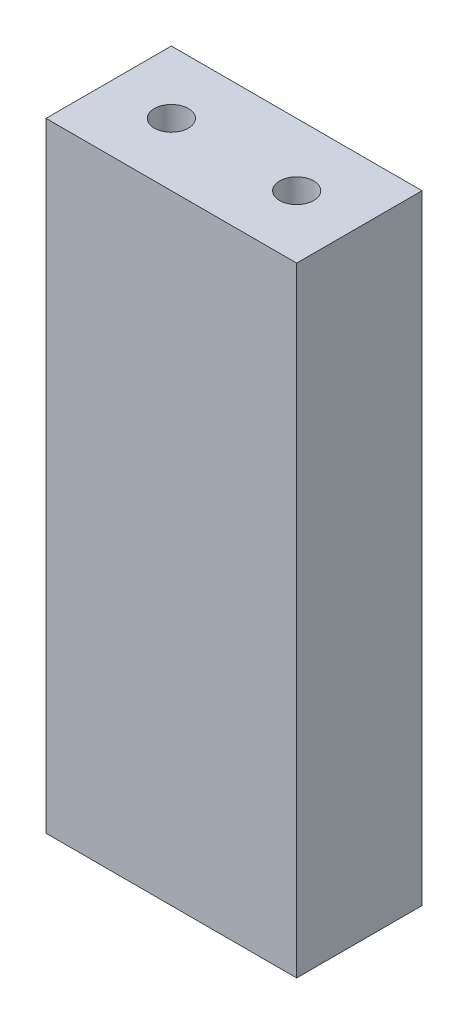
ISO-10303-21;
HEADER;
FILE_DESCRIPTION(('STEP AP214'),'2;1');
FILE_NAME('part.step','',(''),(''),'','','');
FILE_SCHEMA(('AUTOMOTIVE_DESIGN { 1 0 10303 214 1 1 1 1 }'));
ENDSEC;
DATA;
#1=APPLICATION_CONTEXT('core data for automotive mechanical design processes');
#2=APPLICATION_PROTOCOL_DEFINITION('international standard','automotive_design',2000,#1);
#3=PRODUCT_CONTEXT('',#1,'mechanical');
#4=PRODUCT('Part','Part','',(#3));
#5=PRODUCT_RELATED_PRODUCT_CATEGORY('part','',(#4));
#6=PRODUCT_DEFINITION_FORMATION('','',#4);
#7=PRODUCT_DEFINITION_CONTEXT('part definition',#1,'design');
#8=PRODUCT_DEFINITION('design','',#6,#7);
#9=PRODUCT_DEFINITION_SHAPE('','',#8);
#10=(LENGTH_UNIT() NAMED_UNIT(*) SI_UNIT(.MILLI.,.METRE.));
#11=(NAMED_UNIT(*) PLANE_ANGLE_UNIT() SI_UNIT($,.RADIAN.));
#12=(NAMED_UNIT(*) SI_UNIT($,.STERADIAN.) SOLID_ANGLE_UNIT());
#13=UNCERTAINTY_MEASURE_WITH_UNIT(LENGTH_MEASURE(1.E-05),#10,'distance_accuracy_value','');
#14=(GEOMETRIC_REPRESENTATION_CONTEXT(3) GLOBAL_UNCERTAINTY_ASSIGNED_CONTEXT((#13)) GLOBAL_UNIT_ASSIGNED_CONTEXT((#10,
#11,#12)) REPRESENTATION_CONTEXT('',''));
#15=CARTESIAN_POINT('',(0.,0.,0.));
#16=DIRECTION('',(0.,0.,1.));
#17=DIRECTION('',(1.,0.,0.));
#18=AXIS2_PLACEMENT_3D('',#15,#16,#17);
#19=CARTESIAN_POINT('',(0.,62.738,0.));
#20=DIRECTION('',(1.,0.,0.));
#21=DIRECTION('',(0.,0.,-1.));
#22=AXIS2_PLACEMENT_3D('',#19,#20,#21);
#23=PLANE('',#22);
#24=DIRECTION('',(0.,0.,1.));
#25=VECTOR('',#24,1.);
#26=CARTESIAN_POINT('',(0.,0.,0.));
#27=LINE('',#26,#25);
#28=CARTESIAN_POINT('',(0.,0.,0.));
#29=VERTEX_POINT('',#28);
#30=CARTESIAN_POINT('',(0.,0.,12.7));
#31=VERTEX_POINT('',#30);
#32=EDGE_CURVE('E131',#29,#31,#27,.T.);
#33=ORIENTED_EDGE('',*,*,#32,.T.);
#34=DIRECTION('',(0.,-1.,0.));
#35=VECTOR('',#34,1.);
#36=CARTESIAN_POINT('',(0.,62.738,12.7));
#37=LINE('',#36,#35);
#38=CARTESIAN_POINT('',(0.,62.738,12.7));
#39=VERTEX_POINT('',#38);
#40=EDGE_CURVE('E11',#39,#31,#37,.T.);
#41=ORIENTED_EDGE('',*,*,#40,.F.);
#42=DIRECTION('',(0.,0.,1.));
#43=VECTOR('',#42,1.);
#44=CARTESIAN_POINT('',(0.,62.738,0.));
#45=LINE('',#44,#43);
#46=CARTESIAN_POINT('',(0.,62.738,0.));
#47=VERTEX_POINT('',#46);
#48=EDGE_CURVE('E132',#47,#39,#45,.T.);
#49=ORIENTED_EDGE('',*,*,#48,.F.);
#50=DIRECTION('',(0.,-1.,0.));
#51=VECTOR('',#50,1.);
#52=CARTESIAN_POINT('',(0.,62.738,0.));
#53=LINE('',#52,#51);
#54=EDGE_CURVE('E138',#47,#29,#53,.T.);
#55=ORIENTED_EDGE('',*,*,#54,.T.);
#56=EDGE_LOOP('',(#33,#41,#49,#55));
#57=FACE_BOUND('',#56,.T.);
#58=ADVANCED_FACE('F38',(#57),#23,.F.);
#59=CARTESIAN_POINT('',(0.,62.738,12.7));
#60=DIRECTION('',(0.,0.,-1.));
#61=DIRECTION('',(-1.,0.,0.));
#62=AXIS2_PLACEMENT_3D('',#59,#60,#61);
#63=PLANE('',#62);
#64=DIRECTION('',(1.,0.,0.));
#65=VECTOR('',#64,1.);
#66=CARTESIAN_POINT('',(0.,0.,12.7));
#67=LINE('',#66,#65);
#68=CARTESIAN_POINT('',(25.4,0.,12.7));
#69=VERTEX_POINT('',#68);
#70=EDGE_CURVE('E141',#31,#69,#67,.T.);
#71=ORIENTED_EDGE('',*,*,#70,.T.);
#72=DIRECTION('',(0.,-1.,0.));
#73=VECTOR('',#72,1.);
#74=CARTESIAN_POINT('',(25.4,62.738,12.7));
#75=LINE('',#74,#73);
#76=CARTESIAN_POINT('',(25.4,62.738,12.7));
#77=VERTEX_POINT('',#76);
#78=EDGE_CURVE('E46',#77,#69,#75,.T.);
#79=ORIENTED_EDGE('',*,*,#78,.F.);
#80=DIRECTION('',(1.,0.,0.));
#81=VECTOR('',#80,1.);
#82=CARTESIAN_POINT('',(0.,62.738,12.7));
#83=LINE('',#82,#81);
#84=EDGE_CURVE('E85',#39,#77,#83,.T.);
#85=ORIENTED_EDGE('',*,*,#84,.F.);
#86=ORIENTED_EDGE('',*,*,#40,.T.);
#87=EDGE_LOOP('',(#71,#79,#85,#86));
#88=FACE_BOUND('',#87,.T.);
#89=ADVANCED_FACE('F165',(#88),#63,.F.);
#90=CARTESIAN_POINT('',(25.4,62.738,0.));
#91=DIRECTION('',(-1.,0.,0.));
#92=DIRECTION('',(0.,0.,1.));
#93=AXIS2_PLACEMENT_3D('',#90,#91,#92);
#94=PLANE('',#93);
#95=DIRECTION('',(0.,0.,-1.));
#96=VECTOR('',#95,1.);
#97=CARTESIAN_POINT('',(25.4,0.,0.));
#98=LINE('',#97,#96);
#99=CARTESIAN_POINT('',(25.4,0.,0.));
#100=VERTEX_POINT('',#99);
#101=EDGE_CURVE('E72',#69,#100,#98,.T.);
#102=ORIENTED_EDGE('',*,*,#101,.T.);
#103=DIRECTION('',(0.,-1.,0.));
#104=VECTOR('',#103,1.);
#105=CARTESIAN_POINT('',(25.4,62.738,0.));
#106=LINE('',#105,#104);
#107=CARTESIAN_POINT('',(25.4,62.738,0.));
#108=VERTEX_POINT('',#107);
#109=EDGE_CURVE('E146',#108,#100,#106,.T.);
#110=ORIENTED_EDGE('',*,*,#109,.F.);
#111=DIRECTION('',(0.,0.,-1.));
#112=VECTOR('',#111,1.);
#113=CARTESIAN_POINT('',(25.4,62.738,0.));
#114=LINE('',#113,#112);
#115=EDGE_CURVE('E135',#77,#108,#114,.T.);
#116=ORIENTED_EDGE('',*,*,#115,.F.);
#117=ORIENTED_EDGE('',*,*,#78,.T.);
#118=EDGE_LOOP('',(#102,#110,#116,#117));
#119=FACE_BOUND('',#118,.T.);
#120=ADVANCED_FACE('F148',(#119),#94,.F.);
#121=CARTESIAN_POINT('',(0.,62.738,0.));
#122=DIRECTION('',(0.,0.,1.));
#123=DIRECTION('',(1.,0.,0.));
#124=AXIS2_PLACEMENT_3D('',#121,#122,#123);
#125=PLANE('',#124);
#126=DIRECTION('',(-1.,0.,0.));
#127=VECTOR('',#126,1.);
#128=CARTESIAN_POINT('',(0.,0.,0.));
#129=LINE('',#128,#127);
#130=EDGE_CURVE('E78',#100,#29,#129,.T.);
#131=ORIENTED_EDGE('',*,*,#130,.T.);
#132=ORIENTED_EDGE('',*,*,#54,.F.);
#133=DIRECTION('',(-1.,0.,0.));
#134=VECTOR('',#133,1.);
#135=CARTESIAN_POINT('',(0.,62.738,0.));
#136=LINE('',#135,#134);
#137=EDGE_CURVE('E54',#108,#47,#136,.T.);
#138=ORIENTED_EDGE('',*,*,#137,.F.);
#139=ORIENTED_EDGE('',*,*,#109,.T.);
#140=EDGE_LOOP('',(#131,#132,#138,#139));
#141=FACE_BOUND('',#140,.T.);
#142=ADVANCED_FACE('F155',(#141),#125,.F.);
#143=CARTESIAN_POINT('',(0.,62.738,0.));
#144=DIRECTION('',(0.,1.,0.));
#145=DIRECTION('',(0.,0.,1.));
#146=AXIS2_PLACEMENT_3D('',#143,#144,#145);
#147=PLANE('',#146);
#148=CARTESIAN_POINT('',(6.35,62.738,6.35));
#149=DIRECTION('',(0.,1.,0.));
#150=DIRECTION('',(0.,0.,1.));
#151=AXIS2_PLACEMENT_3D('',#148,#149,#150);
#152=CIRCLE('',#151,1.7272);
#153=CARTESIAN_POINT('',(6.35,62.738,8.0772));
#154=VERTEX_POINT('',#153);
#155=EDGE_CURVE('E109',#154,#154,#152,.T.);
#156=ORIENTED_EDGE('',*,*,#155,.F.);
#157=EDGE_LOOP('',(#156));
#158=FACE_BOUND('',#157,.T.);
#159=CARTESIAN_POINT('',(19.05,62.738,6.35));
#160=DIRECTION('',(0.,1.,0.));
#161=DIRECTION('',(0.,0.,1.));
#162=AXIS2_PLACEMENT_3D('',#159,#160,#161);
#163=CIRCLE('',#162,1.7272);
#164=CARTESIAN_POINT('',(19.05,62.738,8.0772));
#165=VERTEX_POINT('',#164);
#166=EDGE_CURVE('E108',#165,#165,#163,.T.);
#167=ORIENTED_EDGE('',*,*,#166,.F.);
#168=EDGE_LOOP('',(#167));
#169=FACE_BOUND('',#168,.T.);
#170=ORIENTED_EDGE('',*,*,#48,.T.);
#171=ORIENTED_EDGE('',*,*,#84,.T.);
#172=ORIENTED_EDGE('',*,*,#115,.T.);
#173=ORIENTED_EDGE('',*,*,#137,.T.);
#174=EDGE_LOOP('',(#170,#171,#172,#173));
#175=FACE_BOUND('',#174,.T.);
#176=ADVANCED_FACE('F157',(#158,#169,#175),#147,.T.);
#177=CARTESIAN_POINT('',(0.,0.,0.));
#178=DIRECTION('',(0.,1.,0.));
#179=DIRECTION('',(0.,0.,1.));
#180=AXIS2_PLACEMENT_3D('',#177,#178,#179);
#181=PLANE('',#180);
#182=CARTESIAN_POINT('',(3.175,0.,6.35));
#183=DIRECTION('',(0.,-1.,0.));
#184=DIRECTION('',(0.,0.,-1.));
#185=AXIS2_PLACEMENT_3D('',#182,#183,#184);
#186=CIRCLE('',#185,0.888999999999998);
#187=CARTESIAN_POINT('',(3.175,0.,5.461));
#188=VERTEX_POINT('',#187);
#189=EDGE_CURVE('E119',#188,#188,#186,.T.);
#190=ORIENTED_EDGE('',*,*,#189,.F.);
#191=EDGE_LOOP('',(#190));
#192=FACE_BOUND('',#191,.T.);
#193=CARTESIAN_POINT('',(22.225,0.,6.35));
#194=DIRECTION('',(0.,-1.,0.));
#195=DIRECTION('',(0.,0.,-1.));
#196=AXIS2_PLACEMENT_3D('',#193,#194,#195);
#197=CIRCLE('',#196,0.888999999999997);
#198=CARTESIAN_POINT('',(22.225,0.,5.461));
#199=VERTEX_POINT('',#198);
#200=EDGE_CURVE('E125',#199,#199,#197,.T.);
#201=ORIENTED_EDGE('',*,*,#200,.F.);
#202=EDGE_LOOP('',(#201));
#203=FACE_BOUND('',#202,.T.);
#204=ORIENTED_EDGE('',*,*,#32,.F.);
#205=ORIENTED_EDGE('',*,*,#130,.F.);
#206=ORIENTED_EDGE('',*,*,#101,.F.);
#207=ORIENTED_EDGE('',*,*,#70,.F.);
#208=EDGE_LOOP('',(#204,#205,#206,#207));
#209=FACE_BOUND('',#208,.T.);
#210=ADVANCED_FACE('F151',(#192,#203,#209),#181,.F.);
#211=CARTESIAN_POINT('',(22.225,10.8204,6.35));
#212=DIRECTION('',(0.,-1.,0.));
#213=DIRECTION('',(0.,0.,-1.));
#214=AXIS2_PLACEMENT_3D('',#211,#212,#213);
#215=CONICAL_SURFACE('',#214,0.888999999999997,1.02974425867665);
#216=CARTESIAN_POINT('',(22.225,11.3545650903155,6.35));
#217=VERTEX_POINT('',#216);
#218=VERTEX_LOOP('',#217);
#219=FACE_BOUND('',#218,.T.);
#220=CARTESIAN_POINT('',(22.225,10.8204,6.35));
#221=DIRECTION('',(0.,-1.,0.));
#222=DIRECTION('',(0.,0.,-1.));
#223=AXIS2_PLACEMENT_3D('',#220,#221,#222);
#224=CIRCLE('',#223,0.888999999999997);
#225=CARTESIAN_POINT('',(22.225,10.8204,5.461));
#226=VERTEX_POINT('',#225);
#227=EDGE_CURVE('E128',#226,#226,#224,.T.);
#228=ORIENTED_EDGE('',*,*,#227,.T.);
#229=EDGE_LOOP('',(#228));
#230=FACE_BOUND('',#229,.T.);
#231=ADVANCED_FACE('F192',(#219,#230),#215,.F.);
#232=CARTESIAN_POINT('',(22.225,0.,6.35));
#233=DIRECTION('',(0.,-1.,0.));
#234=DIRECTION('',(0.,0.,-1.));
#235=AXIS2_PLACEMENT_3D('',#232,#233,#234);
#236=CYLINDRICAL_SURFACE('',#235,0.888999999999997);
#237=ORIENTED_EDGE('',*,*,#227,.F.);
#238=EDGE_LOOP('',(#237));
#239=FACE_BOUND('',#238,.T.);
#240=ORIENTED_EDGE('',*,*,#200,.T.);
#241=EDGE_LOOP('',(#240));
#242=FACE_BOUND('',#241,.T.);
#243=ADVANCED_FACE('F201',(#239,#242),#236,.F.);
#244=CARTESIAN_POINT('',(3.175,10.8204,6.35));
#245=DIRECTION('',(0.,-1.,0.));
#246=DIRECTION('',(0.,0.,-1.));
#247=AXIS2_PLACEMENT_3D('',#244,#245,#246);
#248=CONICAL_SURFACE('',#247,0.888999999999997,1.02974425867665);
#249=CARTESIAN_POINT('',(3.175,11.3545650903155,6.35));
#250=VERTEX_POINT('',#249);
#251=VERTEX_LOOP('',#250);
#252=FACE_BOUND('',#251,.T.);
#253=CARTESIAN_POINT('',(3.175,10.8204,6.35));
#254=DIRECTION('',(0.,-1.,0.));
#255=DIRECTION('',(0.,0.,-1.));
#256=AXIS2_PLACEMENT_3D('',#253,#254,#255);
#257=CIRCLE('',#256,0.888999999999997);
#258=CARTESIAN_POINT('',(3.175,10.8204,5.461));
#259=VERTEX_POINT('',#258);
#260=EDGE_CURVE('E122',#259,#259,#257,.T.);
#261=ORIENTED_EDGE('',*,*,#260,.T.);
#262=EDGE_LOOP('',(#261));
#263=FACE_BOUND('',#262,.T.);
#264=ADVANCED_FACE('F211',(#252,#263),#248,.F.);
#265=CARTESIAN_POINT('',(3.175,0.,6.35));
#266=DIRECTION('',(0.,-1.,0.));
#267=DIRECTION('',(0.,0.,-1.));
#268=AXIS2_PLACEMENT_3D('',#265,#266,#267);
#269=CYLINDRICAL_SURFACE('',#268,0.888999999999998);
#270=ORIENTED_EDGE('',*,*,#260,.F.);
#271=EDGE_LOOP('',(#270));
#272=FACE_BOUND('',#271,.T.);
#273=ORIENTED_EDGE('',*,*,#189,.T.);
#274=EDGE_LOOP('',(#273));
#275=FACE_BOUND('',#274,.T.);
#276=ADVANCED_FACE('F221',(#272,#275),#269,.F.);
#277=CARTESIAN_POINT('',(19.05,52.02936,6.35));
#278=DIRECTION('',(0.,1.,0.));
#279=DIRECTION('',(0.,0.,1.));
#280=AXIS2_PLACEMENT_3D('',#277,#278,#279);
#281=CONICAL_SURFACE('',#280,1.7272,1.02974425867665);
#282=CARTESIAN_POINT('',(19.05,50.9915535388156,6.35));
#283=VERTEX_POINT('',#282);
#284=VERTEX_LOOP('',#283);
#285=FACE_BOUND('',#284,.T.);
#286=CARTESIAN_POINT('',(19.05,52.02936,6.35));
#287=DIRECTION('',(0.,1.,0.));
#288=DIRECTION('',(0.,0.,1.));
#289=AXIS2_PLACEMENT_3D('',#286,#287,#288);
#290=CIRCLE('',#289,1.7272);
#291=CARTESIAN_POINT('',(19.05,52.02936,8.0772));
#292=VERTEX_POINT('',#291);
#293=EDGE_CURVE('E112',#292,#292,#290,.T.);
#294=ORIENTED_EDGE('',*,*,#293,.T.);
#295=EDGE_LOOP('',(#294));
#296=FACE_BOUND('',#295,.T.);
#297=ADVANCED_FACE('F231',(#285,#296),#281,.F.);
#298=CARTESIAN_POINT('',(19.05,62.738,6.35));
#299=DIRECTION('',(0.,1.,0.));
#300=DIRECTION('',(0.,0.,1.));
#301=AXIS2_PLACEMENT_3D('',#298,#299,#300);
#302=CYLINDRICAL_SURFACE('',#301,1.7272);
#303=ORIENTED_EDGE('',*,*,#293,.F.);
#304=EDGE_LOOP('',(#303));
#305=FACE_BOUND('',#304,.T.);
#306=ORIENTED_EDGE('',*,*,#166,.T.);
#307=EDGE_LOOP('',(#306));
#308=FACE_BOUND('',#307,.T.);
#309=ADVANCED_FACE('F102',(#305,#308),#302,.F.);
#310=CARTESIAN_POINT('',(6.35,52.02936,6.35));
#311=DIRECTION('',(0.,1.,0.));
#312=DIRECTION('',(0.,0.,1.));
#313=AXIS2_PLACEMENT_3D('',#310,#311,#312);
#314=CONICAL_SURFACE('',#313,1.7272,1.02974425867665);
#315=CARTESIAN_POINT('',(6.35,50.9915535388156,6.35));
#316=VERTEX_POINT('',#315);
#317=VERTEX_LOOP('',#316);
#318=FACE_BOUND('',#317,.T.);
#319=CARTESIAN_POINT('',(6.35,52.02936,6.35));
#320=DIRECTION('',(0.,1.,0.));
#321=DIRECTION('',(0.,0.,1.));
#322=AXIS2_PLACEMENT_3D('',#319,#320,#321);
#323=CIRCLE('',#322,1.7272);
#324=CARTESIAN_POINT('',(6.35,52.02936,8.0772));
#325=VERTEX_POINT('',#324);
#326=EDGE_CURVE('E106',#325,#325,#323,.T.);
#327=ORIENTED_EDGE('',*,*,#326,.T.);
#328=EDGE_LOOP('',(#327));
#329=FACE_BOUND('',#328,.T.);
#330=ADVANCED_FACE('F98',(#318,#329),#314,.F.);
#331=CARTESIAN_POINT('',(6.35,62.738,6.35));
#332=DIRECTION('',(0.,1.,0.));
#333=DIRECTION('',(0.,0.,1.));
#334=AXIS2_PLACEMENT_3D('',#331,#332,#333);
#335=CYLINDRICAL_SURFACE('',#334,1.7272);
#336=ORIENTED_EDGE('',*,*,#326,.F.);
#337=EDGE_LOOP('',(#336));
#338=FACE_BOUND('',#337,.T.);
#339=ORIENTED_EDGE('',*,*,#155,.T.);
#340=EDGE_LOOP('',(#339));
#341=FACE_BOUND('',#340,.T.);
#342=ADVANCED_FACE('F101',(#338,#341),#335,.F.);
#343=CLOSED_SHELL('',(#58,#89,#120,#142,#176,#210,#231,#243,#264,#276,#297,#309,#330,#342));
#344=MANIFOLD_SOLID_BREP('B2',#343);
#345=ADVANCED_BREP_SHAPE_REPRESENTATION('',(#18,#344),#14);
#346=SHAPE_DEFINITION_REPRESENTATION(#9,#345);
ENDSEC;
END-ISO-10303-21;
